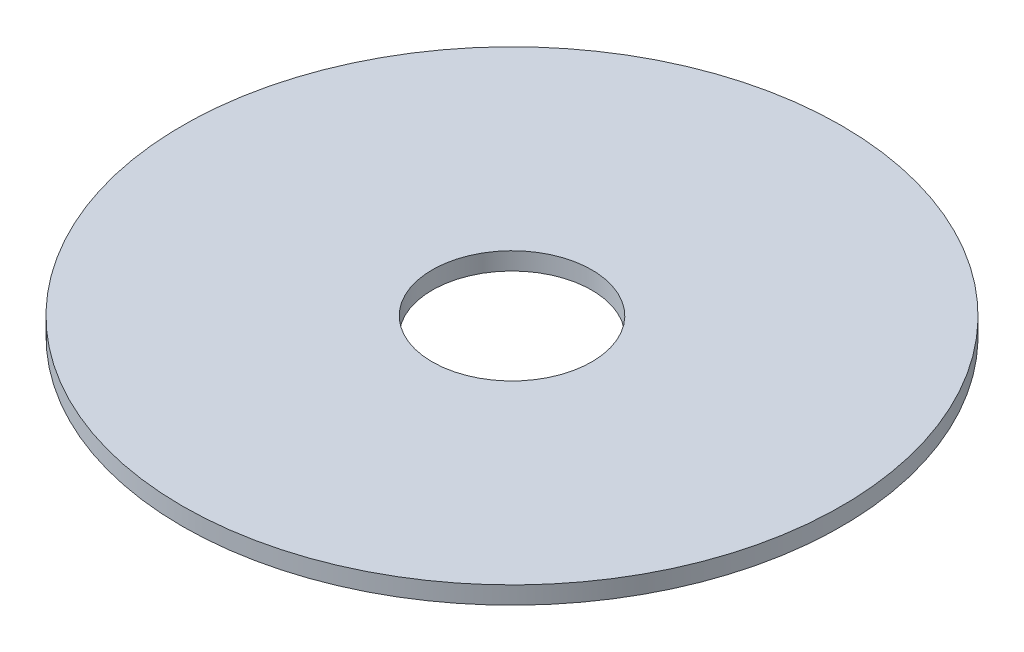
ISO-10303-21;
HEADER;
FILE_DESCRIPTION(('STEP AP214'),'2;1');
FILE_NAME('part.step','',(''),(''),'','','');
FILE_SCHEMA(('AUTOMOTIVE_DESIGN { 1 0 10303 214 1 1 1 1 }'));
ENDSEC;
DATA;
#1=APPLICATION_CONTEXT('core data for automotive mechanical design processes');
#2=APPLICATION_PROTOCOL_DEFINITION('international standard','automotive_design',2000,#1);
#3=PRODUCT_CONTEXT('',#1,'mechanical');
#4=PRODUCT('Part','Part','',(#3));
#5=PRODUCT_RELATED_PRODUCT_CATEGORY('part','',(#4));
#6=PRODUCT_DEFINITION_FORMATION('','',#4);
#7=PRODUCT_DEFINITION_CONTEXT('part definition',#1,'design');
#8=PRODUCT_DEFINITION('design','',#6,#7);
#9=PRODUCT_DEFINITION_SHAPE('','',#8);
#10=(LENGTH_UNIT() NAMED_UNIT(*) SI_UNIT(.MILLI.,.METRE.));
#11=(NAMED_UNIT(*) PLANE_ANGLE_UNIT() SI_UNIT($,.RADIAN.));
#12=(NAMED_UNIT(*) SI_UNIT($,.STERADIAN.) SOLID_ANGLE_UNIT());
#13=UNCERTAINTY_MEASURE_WITH_UNIT(LENGTH_MEASURE(1.E-05),#10,'distance_accuracy_value','');
#14=(GEOMETRIC_REPRESENTATION_CONTEXT(3) GLOBAL_UNCERTAINTY_ASSIGNED_CONTEXT((#13)) GLOBAL_UNIT_ASSIGNED_CONTEXT((#10,
#11,#12)) REPRESENTATION_CONTEXT('',''));
#15=CARTESIAN_POINT('',(0.,0.,0.));
#16=DIRECTION('',(0.,0.,1.));
#17=DIRECTION('',(1.,0.,0.));
#18=AXIS2_PLACEMENT_3D('',#15,#16,#17);
#19=CARTESIAN_POINT('',(0.,0.,0.));
#20=DIRECTION('',(0.,1.,0.));
#21=DIRECTION('',(0.,0.,1.));
#22=AXIS2_PLACEMENT_3D('',#19,#20,#21);
#23=PLANE('',#22);
#24=CARTESIAN_POINT('',(0.,0.,0.));
#25=DIRECTION('',(0.,1.,0.));
#26=DIRECTION('',(0.,0.,1.));
#27=AXIS2_PLACEMENT_3D('',#24,#25,#26);
#28=CIRCLE('',#27,93.6961873230378);
#29=CARTESIAN_POINT('',(0.,0.,93.6961873230378));
#30=VERTEX_POINT('',#29);
#31=EDGE_CURVE('E10',#30,#30,#28,.T.);
#32=ORIENTED_EDGE('',*,*,#31,.F.);
#33=EDGE_LOOP('',(#32));
#34=FACE_BOUND('',#33,.T.);
#35=CARTESIAN_POINT('',(0.,0.,0.));
#36=DIRECTION('',(0.,1.,0.));
#37=DIRECTION('',(0.,0.,1.));
#38=AXIS2_PLACEMENT_3D('',#35,#36,#37);
#39=CIRCLE('',#38,22.6840077124814);
#40=CARTESIAN_POINT('',(0.,0.,22.6840077124814));
#41=VERTEX_POINT('',#40);
#42=EDGE_CURVE('E41',#41,#41,#39,.T.);
#43=ORIENTED_EDGE('',*,*,#42,.T.);
#44=EDGE_LOOP('',(#43));
#45=FACE_BOUND('',#44,.T.);
#46=ADVANCED_FACE('F34',(#34,#45),#23,.F.);
#47=CARTESIAN_POINT('',(0.,2.,0.));
#48=DIRECTION('',(0.,-1.,0.));
#49=DIRECTION('',(0.,0.,-1.));
#50=AXIS2_PLACEMENT_3D('',#47,#48,#49);
#51=CYLINDRICAL_SURFACE('',#50,93.6961873230378);
#52=ORIENTED_EDGE('',*,*,#31,.T.);
#53=EDGE_LOOP('',(#52));
#54=FACE_BOUND('',#53,.T.);
#55=CARTESIAN_POINT('',(0.,5.,0.));
#56=DIRECTION('',(0.,1.,0.));
#57=DIRECTION('',(0.,0.,1.));
#58=AXIS2_PLACEMENT_3D('',#55,#56,#57);
#59=CIRCLE('',#58,93.6961873230378);
#60=CARTESIAN_POINT('',(0.,5.,93.6961873230378));
#61=VERTEX_POINT('',#60);
#62=EDGE_CURVE('E45',#61,#61,#59,.T.);
#63=ORIENTED_EDGE('',*,*,#62,.F.);
#64=EDGE_LOOP('',(#63));
#65=FACE_BOUND('',#64,.T.);
#66=ADVANCED_FACE('F36',(#54,#65),#51,.T.);
#67=CARTESIAN_POINT('',(0.,2.,0.));
#68=DIRECTION('',(0.,-1.,0.));
#69=DIRECTION('',(0.,0.,-1.));
#70=AXIS2_PLACEMENT_3D('',#67,#68,#69);
#71=CYLINDRICAL_SURFACE('',#70,22.6840077124814);
#72=ORIENTED_EDGE('',*,*,#42,.F.);
#73=EDGE_LOOP('',(#72));
#74=FACE_BOUND('',#73,.T.);
#75=CARTESIAN_POINT('',(0.,5.,0.));
#76=DIRECTION('',(0.,1.,0.));
#77=DIRECTION('',(0.,0.,1.));
#78=AXIS2_PLACEMENT_3D('',#75,#76,#77);
#79=CIRCLE('',#78,22.6840077124814);
#80=CARTESIAN_POINT('',(0.,5.,22.6840077124814));
#81=VERTEX_POINT('',#80);
#82=EDGE_CURVE('E49',#81,#81,#79,.T.);
#83=ORIENTED_EDGE('',*,*,#82,.T.);
#84=EDGE_LOOP('',(#83));
#85=FACE_BOUND('',#84,.T.);
#86=ADVANCED_FACE('F55',(#74,#85),#71,.F.);
#87=CARTESIAN_POINT('',(0.,5.,0.));
#88=DIRECTION('',(0.,1.,0.));
#89=DIRECTION('',(0.,0.,1.));
#90=AXIS2_PLACEMENT_3D('',#87,#88,#89);
#91=PLANE('',#90);
#92=ORIENTED_EDGE('',*,*,#62,.T.);
#93=EDGE_LOOP('',(#92));
#94=FACE_BOUND('',#93,.T.);
#95=ORIENTED_EDGE('',*,*,#82,.F.);
#96=EDGE_LOOP('',(#95));
#97=FACE_BOUND('',#96,.T.);
#98=ADVANCED_FACE('F57',(#94,#97),#91,.T.);
#99=CLOSED_SHELL('',(#46,#66,#86,#98));
#100=MANIFOLD_SOLID_BREP('B2',#99);
#101=ADVANCED_BREP_SHAPE_REPRESENTATION('',(#18,#100),#14);
#102=SHAPE_DEFINITION_REPRESENTATION(#9,#101);
ENDSEC;
END-ISO-10303-21;
